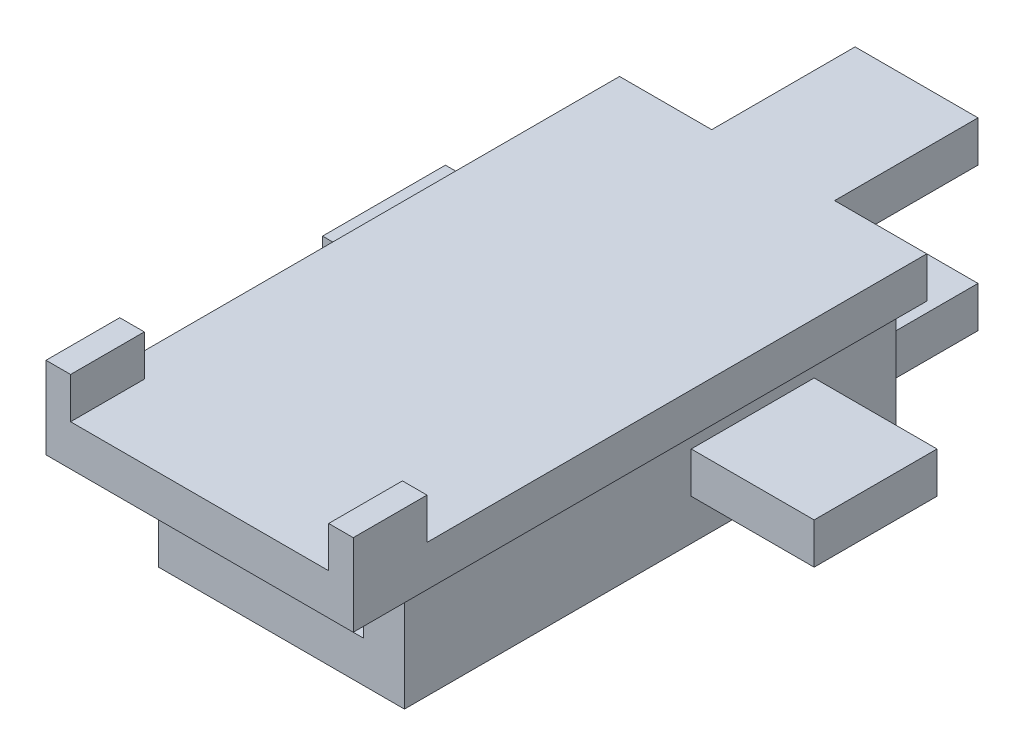
ISO-10303-21;
HEADER;
FILE_DESCRIPTION(('STEP AP214'),'2;1');
FILE_NAME('part.step','',(''),(''),'','','');
FILE_SCHEMA(('AUTOMOTIVE_DESIGN { 1 0 10303 214 1 1 1 1 }'));
ENDSEC;
DATA;
#1=APPLICATION_CONTEXT('core data for automotive mechanical design processes');
#2=APPLICATION_PROTOCOL_DEFINITION('international standard','automotive_design',2000,#1);
#3=PRODUCT_CONTEXT('',#1,'mechanical');
#4=PRODUCT('Part','Part','',(#3));
#5=PRODUCT_RELATED_PRODUCT_CATEGORY('part','',(#4));
#6=PRODUCT_DEFINITION_FORMATION('','',#4);
#7=PRODUCT_DEFINITION_CONTEXT('part definition',#1,'design');
#8=PRODUCT_DEFINITION('design','',#6,#7);
#9=PRODUCT_DEFINITION_SHAPE('','',#8);
#10=(LENGTH_UNIT() NAMED_UNIT(*) SI_UNIT(.MILLI.,.METRE.));
#11=(NAMED_UNIT(*) PLANE_ANGLE_UNIT() SI_UNIT($,.RADIAN.));
#12=(NAMED_UNIT(*) SI_UNIT($,.STERADIAN.) SOLID_ANGLE_UNIT());
#13=UNCERTAINTY_MEASURE_WITH_UNIT(LENGTH_MEASURE(1.E-05),#10,'distance_accuracy_value','');
#14=(GEOMETRIC_REPRESENTATION_CONTEXT(3) GLOBAL_UNCERTAINTY_ASSIGNED_CONTEXT((#13)) GLOBAL_UNIT_ASSIGNED_CONTEXT((#10,
#11,#12)) REPRESENTATION_CONTEXT('',''));
#15=CARTESIAN_POINT('',(0.,0.,0.));
#16=DIRECTION('',(0.,0.,1.));
#17=DIRECTION('',(1.,0.,0.));
#18=AXIS2_PLACEMENT_3D('',#15,#16,#17);
#19=CARTESIAN_POINT('',(3.,-3.,0.));
#20=DIRECTION('',(1.,0.,0.));
#21=DIRECTION('',(0.,0.,-1.));
#22=AXIS2_PLACEMENT_3D('',#19,#20,#21);
#23=PLANE('',#22);
#24=DIRECTION('',(0.,0.,-1.));
#25=VECTOR('',#24,1.);
#26=CARTESIAN_POINT('',(3.,0.,0.));
#27=LINE('',#26,#25);
#28=CARTESIAN_POINT('',(3.,0.,7.));
#29=VERTEX_POINT('',#28);
#30=CARTESIAN_POINT('',(3.,0.,-5.));
#31=VERTEX_POINT('',#30);
#32=EDGE_CURVE('E433',#29,#31,#27,.T.);
#33=ORIENTED_EDGE('',*,*,#32,.F.);
#34=DIRECTION('',(0.,1.,0.));
#35=VECTOR('',#34,1.);
#36=CARTESIAN_POINT('',(3.,-3.,7.));
#37=LINE('',#36,#35);
#38=CARTESIAN_POINT('',(3.,-3.,7.));
#39=VERTEX_POINT('',#38);
#40=EDGE_CURVE('E460',#39,#29,#37,.T.);
#41=ORIENTED_EDGE('',*,*,#40,.F.);
#42=DIRECTION('',(0.,0.,-1.));
#43=VECTOR('',#42,1.);
#44=CARTESIAN_POINT('',(3.,-3.,0.));
#45=LINE('',#44,#43);
#46=CARTESIAN_POINT('',(3.,-3.,-5.));
#47=VERTEX_POINT('',#46);
#48=EDGE_CURVE('E437',#39,#47,#45,.T.);
#49=ORIENTED_EDGE('',*,*,#48,.T.);
#50=DIRECTION('',(0.,1.,0.));
#51=VECTOR('',#50,1.);
#52=CARTESIAN_POINT('',(3.,-3.,-5.));
#53=LINE('',#52,#51);
#54=EDGE_CURVE('E463',#47,#31,#53,.T.);
#55=ORIENTED_EDGE('',*,*,#54,.T.);
#56=EDGE_LOOP('',(#33,#41,#49,#55));
#57=FACE_BOUND('',#56,.T.);
#58=DIRECTION('',(0.,-1.,0.));
#59=VECTOR('',#58,1.);
#60=CARTESIAN_POINT('',(3.,-1.,0.));
#61=LINE('',#60,#59);
#62=CARTESIAN_POINT('',(3.,-1.,0.));
#63=VERTEX_POINT('',#62);
#64=CARTESIAN_POINT('',(3.,-2.,0.));
#65=VERTEX_POINT('',#64);
#66=EDGE_CURVE('E59',#63,#65,#61,.T.);
#67=ORIENTED_EDGE('',*,*,#66,.F.);
#68=DIRECTION('',(0.,0.,1.));
#69=VECTOR('',#68,1.);
#70=CARTESIAN_POINT('',(3.,-1.,-3.));
#71=LINE('',#70,#69);
#72=CARTESIAN_POINT('',(3.,-1.,-3.));
#73=VERTEX_POINT('',#72);
#74=EDGE_CURVE('E287',#73,#63,#71,.T.);
#75=ORIENTED_EDGE('',*,*,#74,.F.);
#76=DIRECTION('',(0.,-1.,0.));
#77=VECTOR('',#76,1.);
#78=CARTESIAN_POINT('',(3.,-1.,-3.));
#79=LINE('',#78,#77);
#80=CARTESIAN_POINT('',(3.,-2.,-3.));
#81=VERTEX_POINT('',#80);
#82=EDGE_CURVE('E295',#73,#81,#79,.T.);
#83=ORIENTED_EDGE('',*,*,#82,.T.);
#84=DIRECTION('',(0.,0.,1.));
#85=VECTOR('',#84,1.);
#86=CARTESIAN_POINT('',(3.,-2.,-3.));
#87=LINE('',#86,#85);
#88=EDGE_CURVE('E307',#81,#65,#87,.T.);
#89=ORIENTED_EDGE('',*,*,#88,.T.);
#90=EDGE_LOOP('',(#67,#75,#83,#89));
#91=FACE_BOUND('',#90,.T.);
#92=ADVANCED_FACE('F36',(#57,#91),#23,.T.);
#93=CARTESIAN_POINT('',(0.,1.,0.));
#94=DIRECTION('',(0.,-1.,0.));
#95=DIRECTION('',(0.,0.,-1.));
#96=AXIS2_PLACEMENT_3D('',#93,#94,#95);
#97=PLANE('',#96);
#98=DIRECTION('',(-1.,0.,0.));
#99=VECTOR('',#98,1.);
#100=CARTESIAN_POINT('',(3.75,1.,7.2));
#101=LINE('',#100,#99);
#102=CARTESIAN_POINT('',(3.75,1.,7.2));
#103=VERTEX_POINT('',#102);
#104=CARTESIAN_POINT('',(3.15,1.,7.2));
#105=VERTEX_POINT('',#104);
#106=EDGE_CURVE('E320',#103,#105,#101,.T.);
#107=ORIENTED_EDGE('',*,*,#106,.F.);
#108=DIRECTION('',(0.,0.,-1.));
#109=VECTOR('',#108,1.);
#110=CARTESIAN_POINT('',(3.75,1.,5.));
#111=LINE('',#110,#109);
#112=CARTESIAN_POINT('',(3.75,1.,-5.));
#113=VERTEX_POINT('',#112);
#114=EDGE_CURVE('E496',#103,#113,#111,.T.);
#115=ORIENTED_EDGE('',*,*,#114,.T.);
#116=DIRECTION('',(-1.,0.,0.));
#117=VECTOR('',#116,1.);
#118=CARTESIAN_POINT('',(-3.75,1.,-5.));
#119=LINE('',#118,#117);
#120=CARTESIAN_POINT('',(1.5,1.,-5.));
#121=VERTEX_POINT('',#120);
#122=EDGE_CURVE('E500',#113,#121,#119,.T.);
#123=ORIENTED_EDGE('',*,*,#122,.T.);
#124=DIRECTION('',(0.,0.,1.));
#125=VECTOR('',#124,1.);
#126=CARTESIAN_POINT('',(1.5,1.,-10.));
#127=LINE('',#126,#125);
#128=CARTESIAN_POINT('',(1.5,1.,-8.5));
#129=VERTEX_POINT('',#128);
#130=EDGE_CURVE('E481',#129,#121,#127,.T.);
#131=ORIENTED_EDGE('',*,*,#130,.F.);
#132=DIRECTION('',(-1.,0.,0.));
#133=VECTOR('',#132,1.);
#134=CARTESIAN_POINT('',(0.,1.,-8.5));
#135=LINE('',#134,#133);
#136=CARTESIAN_POINT('',(-1.5,1.,-8.5));
#137=VERTEX_POINT('',#136);
#138=EDGE_CURVE('E368',#129,#137,#135,.T.);
#139=ORIENTED_EDGE('',*,*,#138,.T.);
#140=DIRECTION('',(0.,0.,1.));
#141=VECTOR('',#140,1.);
#142=CARTESIAN_POINT('',(-1.5,1.,-10.));
#143=LINE('',#142,#141);
#144=CARTESIAN_POINT('',(-1.5,1.,-5.));
#145=VERTEX_POINT('',#144);
#146=EDGE_CURVE('E483',#137,#145,#143,.T.);
#147=ORIENTED_EDGE('',*,*,#146,.T.);
#148=CARTESIAN_POINT('',(-3.75,1.,-5.));
#149=VERTEX_POINT('',#148);
#150=EDGE_CURVE('E498',#145,#149,#119,.T.);
#151=ORIENTED_EDGE('',*,*,#150,.T.);
#152=DIRECTION('',(0.,0.,1.));
#153=VECTOR('',#152,1.);
#154=CARTESIAN_POINT('',(-3.75,1.,5.));
#155=LINE('',#154,#153);
#156=CARTESIAN_POINT('',(-3.75,1.,7.2));
#157=VERTEX_POINT('',#156);
#158=EDGE_CURVE('E503',#149,#157,#155,.T.);
#159=ORIENTED_EDGE('',*,*,#158,.T.);
#160=DIRECTION('',(-1.,0.,0.));
#161=VECTOR('',#160,1.);
#162=CARTESIAN_POINT('',(-3.75,1.,7.2));
#163=LINE('',#162,#161);
#164=CARTESIAN_POINT('',(-3.15,1.,7.2));
#165=VERTEX_POINT('',#164);
#166=EDGE_CURVE('E347',#165,#157,#163,.T.);
#167=ORIENTED_EDGE('',*,*,#166,.F.);
#168=DIRECTION('',(0.,0.,-1.));
#169=VECTOR('',#168,1.);
#170=CARTESIAN_POINT('',(-3.15,1.,7.2));
#171=LINE('',#170,#169);
#172=CARTESIAN_POINT('',(-3.15,1.,9.));
#173=VERTEX_POINT('',#172);
#174=EDGE_CURVE('E342',#173,#165,#171,.T.);
#175=ORIENTED_EDGE('',*,*,#174,.F.);
#176=DIRECTION('',(-1.,0.,0.));
#177=VECTOR('',#176,1.);
#178=CARTESIAN_POINT('',(-3.75,1.,9.));
#179=LINE('',#178,#177);
#180=CARTESIAN_POINT('',(3.15,1.,9.));
#181=VERTEX_POINT('',#180);
#182=EDGE_CURVE('E493',#181,#173,#179,.T.);
#183=ORIENTED_EDGE('',*,*,#182,.F.);
#184=DIRECTION('',(0.,0.,1.));
#185=VECTOR('',#184,1.);
#186=CARTESIAN_POINT('',(3.15,1.,7.2));
#187=LINE('',#186,#185);
#188=EDGE_CURVE('E325',#105,#181,#187,.T.);
#189=ORIENTED_EDGE('',*,*,#188,.F.);
#190=EDGE_LOOP('',(#107,#115,#123,#131,#139,#147,#151,#159,#167,#175,#183,#189));
#191=FACE_BOUND('',#190,.T.);
#192=ADVANCED_FACE('F542',(#191),#97,.F.);
#193=CARTESIAN_POINT('',(-3.75,1.,-5.));
#194=DIRECTION('',(0.,0.,1.));
#195=DIRECTION('',(1.,0.,0.));
#196=AXIS2_PLACEMENT_3D('',#193,#194,#195);
#197=PLANE('',#196);
#198=DIRECTION('',(0.,-1.,0.));
#199=VECTOR('',#198,1.);
#200=CARTESIAN_POINT('',(2.,-2.,-5.));
#201=LINE('',#200,#199);
#202=CARTESIAN_POINT('',(2.,-2.,-5.));
#203=VERTEX_POINT('',#202);
#204=CARTESIAN_POINT('',(2.,-3.,-5.));
#205=VERTEX_POINT('',#204);
#206=EDGE_CURVE('E383',#203,#205,#201,.T.);
#207=ORIENTED_EDGE('',*,*,#206,.F.);
#208=DIRECTION('',(0.,1.,0.));
#209=VECTOR('',#208,1.);
#210=CARTESIAN_POINT('',(2.,0.,-5.));
#211=LINE('',#210,#209);
#212=CARTESIAN_POINT('',(2.,0.,-5.));
#213=VERTEX_POINT('',#212);
#214=EDGE_CURVE('E410',#203,#213,#211,.T.);
#215=ORIENTED_EDGE('',*,*,#214,.T.);
#216=DIRECTION('',(1.,0.,0.));
#217=VECTOR('',#216,1.);
#218=CARTESIAN_POINT('',(0.,0.,-5.));
#219=LINE('',#218,#217);
#220=CARTESIAN_POINT('',(1.5,0.,-5.));
#221=VERTEX_POINT('',#220);
#222=EDGE_CURVE('E414',#221,#213,#219,.T.);
#223=ORIENTED_EDGE('',*,*,#222,.F.);
#224=DIRECTION('',(0.,-1.,0.));
#225=VECTOR('',#224,1.);
#226=CARTESIAN_POINT('',(1.5,0.,-5.));
#227=LINE('',#226,#225);
#228=EDGE_CURVE('E472',#121,#221,#227,.T.);
#229=ORIENTED_EDGE('',*,*,#228,.F.);
#230=ORIENTED_EDGE('',*,*,#122,.F.);
#231=DIRECTION('',(0.,-1.,0.));
#232=VECTOR('',#231,1.);
#233=CARTESIAN_POINT('',(3.75,1.,-5.));
#234=LINE('',#233,#232);
#235=CARTESIAN_POINT('',(3.75,0.,-5.));
#236=VERTEX_POINT('',#235);
#237=EDGE_CURVE('E11',#113,#236,#234,.T.);
#238=ORIENTED_EDGE('',*,*,#237,.T.);
#239=DIRECTION('',(-1.,0.,0.));
#240=VECTOR('',#239,1.);
#241=CARTESIAN_POINT('',(-3.75,0.,-5.));
#242=LINE('',#241,#240);
#243=EDGE_CURVE('E508',#236,#31,#242,.T.);
#244=ORIENTED_EDGE('',*,*,#243,.T.);
#245=ORIENTED_EDGE('',*,*,#54,.F.);
#246=DIRECTION('',(-1.,0.,0.));
#247=VECTOR('',#246,1.);
#248=CARTESIAN_POINT('',(0.,-3.,-5.));
#249=LINE('',#248,#247);
#250=EDGE_CURVE('E434',#47,#205,#249,.T.);
#251=ORIENTED_EDGE('',*,*,#250,.T.);
#252=EDGE_LOOP('',(#207,#215,#223,#229,#230,#238,#244,#245,#251));
#253=FACE_BOUND('',#252,.T.);
#254=ADVANCED_FACE('F565',(#253),#197,.F.);
#255=DIRECTION('',(0.,1.,0.));
#256=VECTOR('',#255,1.);
#257=CARTESIAN_POINT('',(-2.,-2.,-5.));
#258=LINE('',#257,#256);
#259=CARTESIAN_POINT('',(-2.,-3.,-5.));
#260=VERTEX_POINT('',#259);
#261=CARTESIAN_POINT('',(-2.,-2.,-5.));
#262=VERTEX_POINT('',#261);
#263=EDGE_CURVE('E388',#260,#262,#258,.T.);
#264=ORIENTED_EDGE('',*,*,#263,.F.);
#265=CARTESIAN_POINT('',(-3.,-3.,-5.));
#266=VERTEX_POINT('',#265);
#267=EDGE_CURVE('E438',#260,#266,#249,.T.);
#268=ORIENTED_EDGE('',*,*,#267,.T.);
#269=DIRECTION('',(0.,1.,0.));
#270=VECTOR('',#269,1.);
#271=CARTESIAN_POINT('',(-3.,-3.,-5.));
#272=LINE('',#271,#270);
#273=CARTESIAN_POINT('',(-3.,0.,-5.));
#274=VERTEX_POINT('',#273);
#275=EDGE_CURVE('E447',#266,#274,#272,.T.);
#276=ORIENTED_EDGE('',*,*,#275,.T.);
#277=CARTESIAN_POINT('',(-3.75,0.,-5.));
#278=VERTEX_POINT('',#277);
#279=EDGE_CURVE('E507',#274,#278,#242,.T.);
#280=ORIENTED_EDGE('',*,*,#279,.T.);
#281=DIRECTION('',(0.,-1.,0.));
#282=VECTOR('',#281,1.);
#283=CARTESIAN_POINT('',(-3.75,1.,-5.));
#284=LINE('',#283,#282);
#285=EDGE_CURVE('E44',#149,#278,#284,.T.);
#286=ORIENTED_EDGE('',*,*,#285,.F.);
#287=ORIENTED_EDGE('',*,*,#150,.F.);
#288=DIRECTION('',(0.,1.,0.));
#289=VECTOR('',#288,1.);
#290=CARTESIAN_POINT('',(-1.5,0.,-5.));
#291=LINE('',#290,#289);
#292=CARTESIAN_POINT('',(-1.5,0.,-5.));
#293=VERTEX_POINT('',#292);
#294=EDGE_CURVE('E469',#293,#145,#291,.T.);
#295=ORIENTED_EDGE('',*,*,#294,.F.);
#296=CARTESIAN_POINT('',(-2.,0.,-5.));
#297=VERTEX_POINT('',#296);
#298=EDGE_CURVE('E431',#297,#293,#219,.T.);
#299=ORIENTED_EDGE('',*,*,#298,.F.);
#300=DIRECTION('',(0.,1.,0.));
#301=VECTOR('',#300,1.);
#302=CARTESIAN_POINT('',(-2.,0.,-5.));
#303=LINE('',#302,#301);
#304=EDGE_CURVE('E407',#262,#297,#303,.T.);
#305=ORIENTED_EDGE('',*,*,#304,.F.);
#306=EDGE_LOOP('',(#264,#268,#276,#280,#286,#287,#295,#299,#305));
#307=FACE_BOUND('',#306,.T.);
#308=ADVANCED_FACE('F579',(#307),#197,.F.);
#309=CARTESIAN_POINT('',(0.,-3.,7.));
#310=DIRECTION('',(0.,0.,1.));
#311=DIRECTION('',(1.,0.,0.));
#312=AXIS2_PLACEMENT_3D('',#309,#310,#311);
#313=PLANE('',#312);
#314=DIRECTION('',(1.,0.,0.));
#315=VECTOR('',#314,1.);
#316=CARTESIAN_POINT('',(0.,0.,7.));
#317=LINE('',#316,#315);
#318=CARTESIAN_POINT('',(2.,0.,7.));
#319=VERTEX_POINT('',#318);
#320=EDGE_CURVE('E450',#319,#29,#317,.T.);
#321=ORIENTED_EDGE('',*,*,#320,.F.);
#322=DIRECTION('',(0.,-1.,0.));
#323=VECTOR('',#322,1.);
#324=CARTESIAN_POINT('',(2.,0.,7.));
#325=LINE('',#324,#323);
#326=CARTESIAN_POINT('',(2.,-2.,7.));
#327=VERTEX_POINT('',#326);
#328=EDGE_CURVE('E406',#319,#327,#325,.T.);
#329=ORIENTED_EDGE('',*,*,#328,.T.);
#330=DIRECTION('',(1.,0.,0.));
#331=VECTOR('',#330,1.);
#332=CARTESIAN_POINT('',(0.,-2.,7.));
#333=LINE('',#332,#331);
#334=CARTESIAN_POINT('',(-2.,-2.,7.));
#335=VERTEX_POINT('',#334);
#336=EDGE_CURVE('E420',#335,#327,#333,.T.);
#337=ORIENTED_EDGE('',*,*,#336,.F.);
#338=DIRECTION('',(0.,-1.,0.));
#339=VECTOR('',#338,1.);
#340=CARTESIAN_POINT('',(-2.,0.,7.));
#341=LINE('',#340,#339);
#342=CARTESIAN_POINT('',(-2.,0.,7.));
#343=VERTEX_POINT('',#342);
#344=EDGE_CURVE('E417',#343,#335,#341,.T.);
#345=ORIENTED_EDGE('',*,*,#344,.F.);
#346=CARTESIAN_POINT('',(-3.,0.,7.));
#347=VERTEX_POINT('',#346);
#348=EDGE_CURVE('E451',#347,#343,#317,.T.);
#349=ORIENTED_EDGE('',*,*,#348,.F.);
#350=DIRECTION('',(0.,1.,0.));
#351=VECTOR('',#350,1.);
#352=CARTESIAN_POINT('',(-3.,-3.,7.));
#353=LINE('',#352,#351);
#354=CARTESIAN_POINT('',(-3.,-3.,7.));
#355=VERTEX_POINT('',#354);
#356=EDGE_CURVE('E458',#355,#347,#353,.T.);
#357=ORIENTED_EDGE('',*,*,#356,.F.);
#358=DIRECTION('',(1.,0.,0.));
#359=VECTOR('',#358,1.);
#360=CARTESIAN_POINT('',(0.,-3.,7.));
#361=LINE('',#360,#359);
#362=EDGE_CURVE('E441',#355,#39,#361,.T.);
#363=ORIENTED_EDGE('',*,*,#362,.T.);
#364=ORIENTED_EDGE('',*,*,#40,.T.);
#365=EDGE_LOOP('',(#321,#329,#337,#345,#349,#357,#363,#364));
#366=FACE_BOUND('',#365,.T.);
#367=ADVANCED_FACE('F609',(#366),#313,.T.);
#368=CARTESIAN_POINT('',(-1.5,0.,-10.));
#369=DIRECTION('',(1.,0.,0.));
#370=DIRECTION('',(0.,1.,0.));
#371=AXIS2_PLACEMENT_3D('',#368,#369,#370);
#372=PLANE('',#371);
#373=DIRECTION('',(0.,1.,0.));
#374=VECTOR('',#373,1.);
#375=CARTESIAN_POINT('',(-1.5,0.,-8.5));
#376=LINE('',#375,#374);
#377=CARTESIAN_POINT('',(-1.5,0.,-8.5));
#378=VERTEX_POINT('',#377);
#379=EDGE_CURVE('E465',#378,#137,#376,.T.);
#380=ORIENTED_EDGE('',*,*,#379,.F.);
#381=DIRECTION('',(0.,0.,1.));
#382=VECTOR('',#381,1.);
#383=CARTESIAN_POINT('',(-1.5,0.,-10.));
#384=LINE('',#383,#382);
#385=EDGE_CURVE('E475',#378,#293,#384,.T.);
#386=ORIENTED_EDGE('',*,*,#385,.T.);
#387=ORIENTED_EDGE('',*,*,#294,.T.);
#388=ORIENTED_EDGE('',*,*,#146,.F.);
#389=EDGE_LOOP('',(#380,#386,#387,#388));
#390=FACE_BOUND('',#389,.T.);
#391=ADVANCED_FACE('F574',(#390),#372,.F.);
#392=CARTESIAN_POINT('',(1.5,0.,-10.));
#393=DIRECTION('',(-1.,0.,0.));
#394=DIRECTION('',(0.,-1.,0.));
#395=AXIS2_PLACEMENT_3D('',#392,#393,#394);
#396=PLANE('',#395);
#397=DIRECTION('',(0.,-1.,0.));
#398=VECTOR('',#397,1.);
#399=CARTESIAN_POINT('',(1.5,0.,-8.5));
#400=LINE('',#399,#398);
#401=CARTESIAN_POINT('',(1.5,0.,-8.5));
#402=VERTEX_POINT('',#401);
#403=EDGE_CURVE('E467',#129,#402,#400,.T.);
#404=ORIENTED_EDGE('',*,*,#403,.F.);
#405=ORIENTED_EDGE('',*,*,#130,.T.);
#406=ORIENTED_EDGE('',*,*,#228,.T.);
#407=DIRECTION('',(0.,0.,1.));
#408=VECTOR('',#407,1.);
#409=CARTESIAN_POINT('',(1.5,0.,-10.));
#410=LINE('',#409,#408);
#411=EDGE_CURVE('E478',#402,#221,#410,.T.);
#412=ORIENTED_EDGE('',*,*,#411,.F.);
#413=EDGE_LOOP('',(#404,#405,#406,#412));
#414=FACE_BOUND('',#413,.T.);
#415=ADVANCED_FACE('F569',(#414),#396,.F.);
#416=CARTESIAN_POINT('',(3.75,1.,5.));
#417=DIRECTION('',(-1.,0.,0.));
#418=DIRECTION('',(0.,0.,1.));
#419=AXIS2_PLACEMENT_3D('',#416,#417,#418);
#420=PLANE('',#419);
#421=DIRECTION('',(0.,0.,-1.));
#422=VECTOR('',#421,1.);
#423=CARTESIAN_POINT('',(3.75,0.,5.));
#424=LINE('',#423,#422);
#425=CARTESIAN_POINT('',(3.75,0.,9.));
#426=VERTEX_POINT('',#425);
#427=EDGE_CURVE('E495',#426,#236,#424,.T.);
#428=ORIENTED_EDGE('',*,*,#427,.T.);
#429=ORIENTED_EDGE('',*,*,#237,.F.);
#430=ORIENTED_EDGE('',*,*,#114,.F.);
#431=DIRECTION('',(0.,-1.,0.));
#432=VECTOR('',#431,1.);
#433=CARTESIAN_POINT('',(3.75,2.,7.2));
#434=LINE('',#433,#432);
#435=CARTESIAN_POINT('',(3.75,2.,7.2));
#436=VERTEX_POINT('',#435);
#437=EDGE_CURVE('E332',#436,#103,#434,.T.);
#438=ORIENTED_EDGE('',*,*,#437,.F.);
#439=DIRECTION('',(0.,0.,-1.));
#440=VECTOR('',#439,1.);
#441=CARTESIAN_POINT('',(3.75,2.,7.2));
#442=LINE('',#441,#440);
#443=CARTESIAN_POINT('',(3.75,2.,9.));
#444=VERTEX_POINT('',#443);
#445=EDGE_CURVE('E330',#444,#436,#442,.T.);
#446=ORIENTED_EDGE('',*,*,#445,.F.);
#447=DIRECTION('',(0.,1.,0.));
#448=VECTOR('',#447,1.);
#449=CARTESIAN_POINT('',(3.75,1.,9.));
#450=LINE('',#449,#448);
#451=EDGE_CURVE('E491',#426,#444,#450,.T.);
#452=ORIENTED_EDGE('',*,*,#451,.F.);
#453=EDGE_LOOP('',(#428,#429,#430,#438,#446,#452));
#454=FACE_BOUND('',#453,.T.);
#455=ADVANCED_FACE('F38',(#454),#420,.F.);
#456=CARTESIAN_POINT('',(-3.75,1.,5.));
#457=DIRECTION('',(1.,0.,0.));
#458=DIRECTION('',(0.,0.,-1.));
#459=AXIS2_PLACEMENT_3D('',#456,#457,#458);
#460=PLANE('',#459);
#461=DIRECTION('',(0.,0.,1.));
#462=VECTOR('',#461,1.);
#463=CARTESIAN_POINT('',(-3.75,0.,5.));
#464=LINE('',#463,#462);
#465=CARTESIAN_POINT('',(-3.75,0.,9.));
#466=VERTEX_POINT('',#465);
#467=EDGE_CURVE('E499',#278,#466,#464,.T.);
#468=ORIENTED_EDGE('',*,*,#467,.T.);
#469=DIRECTION('',(0.,-1.,0.));
#470=VECTOR('',#469,1.);
#471=CARTESIAN_POINT('',(-3.75,1.,9.));
#472=LINE('',#471,#470);
#473=CARTESIAN_POINT('',(-3.75,2.,9.));
#474=VERTEX_POINT('',#473);
#475=EDGE_CURVE('E485',#474,#466,#472,.T.);
#476=ORIENTED_EDGE('',*,*,#475,.F.);
#477=DIRECTION('',(0.,0.,1.));
#478=VECTOR('',#477,1.);
#479=CARTESIAN_POINT('',(-3.75,2.,7.2));
#480=LINE('',#479,#478);
#481=CARTESIAN_POINT('',(-3.75,2.,7.2));
#482=VERTEX_POINT('',#481);
#483=EDGE_CURVE('E343',#482,#474,#480,.T.);
#484=ORIENTED_EDGE('',*,*,#483,.F.);
#485=DIRECTION('',(0.,-1.,0.));
#486=VECTOR('',#485,1.);
#487=CARTESIAN_POINT('',(-3.75,2.,7.2));
#488=LINE('',#487,#486);
#489=EDGE_CURVE('E353',#482,#157,#488,.T.);
#490=ORIENTED_EDGE('',*,*,#489,.T.);
#491=ORIENTED_EDGE('',*,*,#158,.F.);
#492=ORIENTED_EDGE('',*,*,#285,.T.);
#493=EDGE_LOOP('',(#468,#476,#484,#490,#491,#492));
#494=FACE_BOUND('',#493,.T.);
#495=ADVANCED_FACE('F516',(#494),#460,.F.);
#496=CARTESIAN_POINT('',(0.,0.,0.));
#497=DIRECTION('',(0.,-1.,0.));
#498=DIRECTION('',(0.,0.,-1.));
#499=AXIS2_PLACEMENT_3D('',#496,#497,#498);
#500=PLANE('',#499);
#501=DIRECTION('',(-1.,0.,0.));
#502=VECTOR('',#501,1.);
#503=CARTESIAN_POINT('',(-3.5,0.,-8.5));
#504=LINE('',#503,#502);
#505=EDGE_CURVE('E366',#402,#378,#504,.T.);
#506=ORIENTED_EDGE('',*,*,#505,.F.);
#507=ORIENTED_EDGE('',*,*,#411,.T.);
#508=ORIENTED_EDGE('',*,*,#222,.T.);
#509=DIRECTION('',(0.,0.,1.));
#510=VECTOR('',#509,1.);
#511=CARTESIAN_POINT('',(2.,0.,-9.47213595499958));
#512=LINE('',#511,#510);
#513=EDGE_CURVE('E423',#213,#319,#512,.T.);
#514=ORIENTED_EDGE('',*,*,#513,.T.);
#515=ORIENTED_EDGE('',*,*,#320,.T.);
#516=ORIENTED_EDGE('',*,*,#32,.T.);
#517=ORIENTED_EDGE('',*,*,#243,.F.);
#518=ORIENTED_EDGE('',*,*,#427,.F.);
#519=DIRECTION('',(1.,0.,0.));
#520=VECTOR('',#519,1.);
#521=CARTESIAN_POINT('',(-3.75,0.,9.));
#522=LINE('',#521,#520);
#523=EDGE_CURVE('E488',#466,#426,#522,.T.);
#524=ORIENTED_EDGE('',*,*,#523,.F.);
#525=ORIENTED_EDGE('',*,*,#467,.F.);
#526=ORIENTED_EDGE('',*,*,#279,.F.);
#527=DIRECTION('',(0.,0.,-1.));
#528=VECTOR('',#527,1.);
#529=CARTESIAN_POINT('',(-3.,0.,0.));
#530=LINE('',#529,#528);
#531=EDGE_CURVE('E454',#347,#274,#530,.T.);
#532=ORIENTED_EDGE('',*,*,#531,.F.);
#533=ORIENTED_EDGE('',*,*,#348,.T.);
#534=DIRECTION('',(0.,0.,1.));
#535=VECTOR('',#534,1.);
#536=CARTESIAN_POINT('',(-2.,0.,-9.47213595499958));
#537=LINE('',#536,#535);
#538=EDGE_CURVE('E427',#297,#343,#537,.T.);
#539=ORIENTED_EDGE('',*,*,#538,.F.);
#540=ORIENTED_EDGE('',*,*,#298,.T.);
#541=ORIENTED_EDGE('',*,*,#385,.F.);
#542=EDGE_LOOP('',(#506,#507,#508,#514,#515,#516,#517,#518,#524,#525,#526,#532,#533,#539,#540,#541));
#543=FACE_BOUND('',#542,.T.);
#544=ADVANCED_FACE('F523',(#543),#500,.T.);
#545=CARTESIAN_POINT('',(0.,0.,9.));
#546=DIRECTION('',(0.,0.,1.));
#547=DIRECTION('',(1.,0.,0.));
#548=AXIS2_PLACEMENT_3D('',#545,#546,#547);
#549=PLANE('',#548);
#550=ORIENTED_EDGE('',*,*,#475,.T.);
#551=ORIENTED_EDGE('',*,*,#523,.T.);
#552=ORIENTED_EDGE('',*,*,#451,.T.);
#553=DIRECTION('',(1.,0.,0.));
#554=VECTOR('',#553,1.);
#555=CARTESIAN_POINT('',(3.75,2.,9.));
#556=LINE('',#555,#554);
#557=CARTESIAN_POINT('',(3.15,2.,9.));
#558=VERTEX_POINT('',#557);
#559=EDGE_CURVE('E327',#558,#444,#556,.T.);
#560=ORIENTED_EDGE('',*,*,#559,.F.);
#561=DIRECTION('',(0.,-1.,0.));
#562=VECTOR('',#561,1.);
#563=CARTESIAN_POINT('',(3.15,2.,9.));
#564=LINE('',#563,#562);
#565=EDGE_CURVE('E338',#558,#181,#564,.T.);
#566=ORIENTED_EDGE('',*,*,#565,.T.);
#567=ORIENTED_EDGE('',*,*,#182,.T.);
#568=DIRECTION('',(0.,-1.,0.));
#569=VECTOR('',#568,1.);
#570=CARTESIAN_POINT('',(-3.15,2.,9.));
#571=LINE('',#570,#569);
#572=CARTESIAN_POINT('',(-3.15,2.,9.));
#573=VERTEX_POINT('',#572);
#574=EDGE_CURVE('E363',#573,#173,#571,.T.);
#575=ORIENTED_EDGE('',*,*,#574,.F.);
#576=DIRECTION('',(1.,0.,0.));
#577=VECTOR('',#576,1.);
#578=CARTESIAN_POINT('',(-3.75,2.,9.));
#579=LINE('',#578,#577);
#580=EDGE_CURVE('E346',#474,#573,#579,.T.);
#581=ORIENTED_EDGE('',*,*,#580,.F.);
#582=EDGE_LOOP('',(#550,#551,#552,#560,#566,#567,#575,#581));
#583=FACE_BOUND('',#582,.T.);
#584=ADVANCED_FACE('F528',(#583),#549,.T.);
#585=CARTESIAN_POINT('',(-3.,-3.,0.));
#586=DIRECTION('',(1.,0.,0.));
#587=DIRECTION('',(0.,0.,-1.));
#588=AXIS2_PLACEMENT_3D('',#585,#586,#587);
#589=PLANE('',#588);
#590=DIRECTION('',(0.,-1.,0.));
#591=VECTOR('',#590,1.);
#592=CARTESIAN_POINT('',(-3.,-1.,-3.));
#593=LINE('',#592,#591);
#594=CARTESIAN_POINT('',(-3.,-1.,-3.));
#595=VERTEX_POINT('',#594);
#596=CARTESIAN_POINT('',(-3.,-2.,-3.));
#597=VERTEX_POINT('',#596);
#598=EDGE_CURVE('E276',#595,#597,#593,.T.);
#599=ORIENTED_EDGE('',*,*,#598,.F.);
#600=DIRECTION('',(0.,0.,1.));
#601=VECTOR('',#600,1.);
#602=CARTESIAN_POINT('',(-3.,-1.,-3.));
#603=LINE('',#602,#601);
#604=CARTESIAN_POINT('',(-3.,-1.,0.));
#605=VERTEX_POINT('',#604);
#606=EDGE_CURVE('E282',#595,#605,#603,.T.);
#607=ORIENTED_EDGE('',*,*,#606,.T.);
#608=DIRECTION('',(0.,-1.,0.));
#609=VECTOR('',#608,1.);
#610=CARTESIAN_POINT('',(-3.,-1.,0.));
#611=LINE('',#610,#609);
#612=CARTESIAN_POINT('',(-3.,-2.,0.));
#613=VERTEX_POINT('',#612);
#614=EDGE_CURVE('E258',#605,#613,#611,.T.);
#615=ORIENTED_EDGE('',*,*,#614,.T.);
#616=DIRECTION('',(0.,0.,1.));
#617=VECTOR('',#616,1.);
#618=CARTESIAN_POINT('',(-3.,-2.,-3.));
#619=LINE('',#618,#617);
#620=EDGE_CURVE('E51',#597,#613,#619,.T.);
#621=ORIENTED_EDGE('',*,*,#620,.F.);
#622=EDGE_LOOP('',(#599,#607,#615,#621));
#623=FACE_BOUND('',#622,.T.);
#624=ORIENTED_EDGE('',*,*,#531,.T.);
#625=ORIENTED_EDGE('',*,*,#275,.F.);
#626=DIRECTION('',(0.,0.,-1.));
#627=VECTOR('',#626,1.);
#628=CARTESIAN_POINT('',(-3.,-3.,0.));
#629=LINE('',#628,#627);
#630=EDGE_CURVE('E444',#355,#266,#629,.T.);
#631=ORIENTED_EDGE('',*,*,#630,.F.);
#632=ORIENTED_EDGE('',*,*,#356,.T.);
#633=EDGE_LOOP('',(#624,#625,#631,#632));
#634=FACE_BOUND('',#633,.T.);
#635=ADVANCED_FACE('F606',(#623,#634),#589,.F.);
#636=CARTESIAN_POINT('',(0.,-3.,0.));
#637=DIRECTION('',(0.,-1.,0.));
#638=DIRECTION('',(0.,0.,-1.));
#639=AXIS2_PLACEMENT_3D('',#636,#637,#638);
#640=PLANE('',#639);
#641=CARTESIAN_POINT('',(0.,-3.,-5.));
#642=DIRECTION('',(0.,-1.,0.));
#643=DIRECTION('',(0.,0.,-1.));
#644=AXIS2_PLACEMENT_3D('',#641,#642,#643);
#645=CIRCLE('',#644,1.);
#646=CARTESIAN_POINT('',(0.,-3.,-6.));
#647=VERTEX_POINT('',#646);
#648=EDGE_CURVE('E371',#647,#647,#645,.T.);
#649=ORIENTED_EDGE('',*,*,#648,.F.);
#650=EDGE_LOOP('',(#649));
#651=FACE_BOUND('',#650,.T.);
#652=CARTESIAN_POINT('',(0.,-3.,5.));
#653=DIRECTION('',(0.,-1.,0.));
#654=DIRECTION('',(0.,0.,-1.));
#655=AXIS2_PLACEMENT_3D('',#652,#653,#654);
#656=CIRCLE('',#655,1.);
#657=CARTESIAN_POINT('',(0.,-3.,4.));
#658=VERTEX_POINT('',#657);
#659=EDGE_CURVE('E377',#658,#658,#656,.T.);
#660=ORIENTED_EDGE('',*,*,#659,.F.);
#661=EDGE_LOOP('',(#660));
#662=FACE_BOUND('',#661,.T.);
#663=ORIENTED_EDGE('',*,*,#250,.F.);
#664=ORIENTED_EDGE('',*,*,#48,.F.);
#665=ORIENTED_EDGE('',*,*,#362,.F.);
#666=ORIENTED_EDGE('',*,*,#630,.T.);
#667=ORIENTED_EDGE('',*,*,#267,.F.);
#668=DIRECTION('',(0.,0.,1.));
#669=VECTOR('',#668,1.);
#670=CARTESIAN_POINT('',(-2.,-3.,-8.));
#671=LINE('',#670,#669);
#672=CARTESIAN_POINT('',(-2.,-3.,-8.));
#673=VERTEX_POINT('',#672);
#674=EDGE_CURVE('E402',#673,#260,#671,.T.);
#675=ORIENTED_EDGE('',*,*,#674,.F.);
#676=DIRECTION('',(-1.,0.,0.));
#677=VECTOR('',#676,1.);
#678=CARTESIAN_POINT('',(2.,-3.,-8.));
#679=LINE('',#678,#677);
#680=CARTESIAN_POINT('',(2.,-3.,-8.));
#681=VERTEX_POINT('',#680);
#682=EDGE_CURVE('E387',#681,#673,#679,.T.);
#683=ORIENTED_EDGE('',*,*,#682,.F.);
#684=DIRECTION('',(0.,0.,1.));
#685=VECTOR('',#684,1.);
#686=CARTESIAN_POINT('',(2.,-3.,-8.));
#687=LINE('',#686,#685);
#688=EDGE_CURVE('E404',#681,#205,#687,.T.);
#689=ORIENTED_EDGE('',*,*,#688,.T.);
#690=EDGE_LOOP('',(#663,#664,#665,#666,#667,#675,#683,#689));
#691=FACE_BOUND('',#690,.T.);
#692=ADVANCED_FACE('F600',(#651,#662,#691),#640,.T.);
#693=CARTESIAN_POINT('',(2.,0.,-9.47213595499958));
#694=DIRECTION('',(-1.,0.,0.));
#695=DIRECTION('',(0.,-1.,0.));
#696=AXIS2_PLACEMENT_3D('',#693,#694,#695);
#697=PLANE('',#696);
#698=DIRECTION('',(0.,0.,1.));
#699=VECTOR('',#698,1.);
#700=CARTESIAN_POINT('',(2.,-2.,-9.47213595499958));
#701=LINE('',#700,#699);
#702=EDGE_CURVE('E411',#203,#327,#701,.T.);
#703=ORIENTED_EDGE('',*,*,#702,.T.);
#704=ORIENTED_EDGE('',*,*,#328,.F.);
#705=ORIENTED_EDGE('',*,*,#513,.F.);
#706=ORIENTED_EDGE('',*,*,#214,.F.);
#707=EDGE_LOOP('',(#703,#704,#705,#706));
#708=FACE_BOUND('',#707,.T.);
#709=ADVANCED_FACE('F612',(#708),#697,.T.);
#710=CARTESIAN_POINT('',(0.,-2.,-9.47213595499958));
#711=DIRECTION('',(0.,-1.,0.));
#712=DIRECTION('',(1.,0.,0.));
#713=AXIS2_PLACEMENT_3D('',#710,#711,#712);
#714=PLANE('',#713);
#715=CARTESIAN_POINT('',(0.,-2.,-5.));
#716=DIRECTION('',(0.,-1.,0.));
#717=DIRECTION('',(1.,0.,0.));
#718=AXIS2_PLACEMENT_3D('',#715,#716,#717);
#719=CIRCLE('',#718,1.);
#720=CARTESIAN_POINT('',(1.,-2.,-5.));
#721=VERTEX_POINT('',#720);
#722=EDGE_CURVE('E374',#721,#721,#719,.F.);
#723=ORIENTED_EDGE('',*,*,#722,.F.);
#724=EDGE_LOOP('',(#723));
#725=FACE_BOUND('',#724,.T.);
#726=CARTESIAN_POINT('',(0.,-2.,5.));
#727=DIRECTION('',(0.,-1.,0.));
#728=DIRECTION('',(1.,0.,0.));
#729=AXIS2_PLACEMENT_3D('',#726,#727,#728);
#730=CIRCLE('',#729,1.);
#731=CARTESIAN_POINT('',(1.,-2.,5.));
#732=VERTEX_POINT('',#731);
#733=EDGE_CURVE('E380',#732,#732,#730,.F.);
#734=ORIENTED_EDGE('',*,*,#733,.F.);
#735=EDGE_LOOP('',(#734));
#736=FACE_BOUND('',#735,.T.);
#737=ORIENTED_EDGE('',*,*,#702,.F.);
#738=DIRECTION('',(0.,0.,1.));
#739=VECTOR('',#738,1.);
#740=CARTESIAN_POINT('',(2.,-2.,-8.));
#741=LINE('',#740,#739);
#742=CARTESIAN_POINT('',(2.,-2.,-8.));
#743=VERTEX_POINT('',#742);
#744=EDGE_CURVE('E394',#743,#203,#741,.T.);
#745=ORIENTED_EDGE('',*,*,#744,.F.);
#746=DIRECTION('',(1.,0.,0.));
#747=VECTOR('',#746,1.);
#748=CARTESIAN_POINT('',(2.,-2.,-8.));
#749=LINE('',#748,#747);
#750=CARTESIAN_POINT('',(-2.,-2.,-8.));
#751=VERTEX_POINT('',#750);
#752=EDGE_CURVE('E392',#751,#743,#749,.T.);
#753=ORIENTED_EDGE('',*,*,#752,.F.);
#754=DIRECTION('',(0.,0.,1.));
#755=VECTOR('',#754,1.);
#756=CARTESIAN_POINT('',(-2.,-2.,-8.));
#757=LINE('',#756,#755);
#758=EDGE_CURVE('E400',#751,#262,#757,.T.);
#759=ORIENTED_EDGE('',*,*,#758,.T.);
#760=DIRECTION('',(0.,0.,1.));
#761=VECTOR('',#760,1.);
#762=CARTESIAN_POINT('',(-2.,-2.,-9.47213595499958));
#763=LINE('',#762,#761);
#764=EDGE_CURVE('E425',#262,#335,#763,.T.);
#765=ORIENTED_EDGE('',*,*,#764,.T.);
#766=ORIENTED_EDGE('',*,*,#336,.T.);
#767=EDGE_LOOP('',(#737,#745,#753,#759,#765,#766));
#768=FACE_BOUND('',#767,.T.);
#769=ADVANCED_FACE('F589',(#725,#736,#768),#714,.F.);
#770=CARTESIAN_POINT('',(-2.,0.,-9.47213595499958));
#771=DIRECTION('',(-1.,0.,0.));
#772=DIRECTION('',(0.,0.,1.));
#773=AXIS2_PLACEMENT_3D('',#770,#771,#772);
#774=PLANE('',#773);
#775=ORIENTED_EDGE('',*,*,#304,.T.);
#776=ORIENTED_EDGE('',*,*,#538,.T.);
#777=ORIENTED_EDGE('',*,*,#344,.T.);
#778=ORIENTED_EDGE('',*,*,#764,.F.);
#779=EDGE_LOOP('',(#775,#776,#777,#778));
#780=FACE_BOUND('',#779,.T.);
#781=ADVANCED_FACE('F585',(#780),#774,.F.);
#782=CARTESIAN_POINT('',(2.,-2.,-8.));
#783=DIRECTION('',(-1.,0.,0.));
#784=DIRECTION('',(0.,0.,1.));
#785=AXIS2_PLACEMENT_3D('',#782,#783,#784);
#786=PLANE('',#785);
#787=ORIENTED_EDGE('',*,*,#206,.T.);
#788=ORIENTED_EDGE('',*,*,#688,.F.);
#789=DIRECTION('',(0.,-1.,0.));
#790=VECTOR('',#789,1.);
#791=CARTESIAN_POINT('',(2.,-2.,-8.));
#792=LINE('',#791,#790);
#793=EDGE_CURVE('E384',#743,#681,#792,.T.);
#794=ORIENTED_EDGE('',*,*,#793,.F.);
#795=ORIENTED_EDGE('',*,*,#744,.T.);
#796=EDGE_LOOP('',(#787,#788,#794,#795));
#797=FACE_BOUND('',#796,.T.);
#798=ADVANCED_FACE('F719',(#797),#786,.F.);
#799=CARTESIAN_POINT('',(-2.,-2.,-8.));
#800=DIRECTION('',(1.,0.,0.));
#801=DIRECTION('',(0.,0.,-1.));
#802=AXIS2_PLACEMENT_3D('',#799,#800,#801);
#803=PLANE('',#802);
#804=ORIENTED_EDGE('',*,*,#263,.T.);
#805=ORIENTED_EDGE('',*,*,#758,.F.);
#806=DIRECTION('',(0.,1.,0.));
#807=VECTOR('',#806,1.);
#808=CARTESIAN_POINT('',(-2.,-2.,-8.));
#809=LINE('',#808,#807);
#810=EDGE_CURVE('E390',#673,#751,#809,.T.);
#811=ORIENTED_EDGE('',*,*,#810,.F.);
#812=ORIENTED_EDGE('',*,*,#674,.T.);
#813=EDGE_LOOP('',(#804,#805,#811,#812));
#814=FACE_BOUND('',#813,.T.);
#815=ADVANCED_FACE('F595',(#814),#803,.F.);
#816=CARTESIAN_POINT('',(0.,0.,-8.));
#817=DIRECTION('',(0.,0.,-1.));
#818=DIRECTION('',(-1.,0.,0.));
#819=AXIS2_PLACEMENT_3D('',#816,#817,#818);
#820=PLANE('',#819);
#821=ORIENTED_EDGE('',*,*,#793,.T.);
#822=ORIENTED_EDGE('',*,*,#682,.T.);
#823=ORIENTED_EDGE('',*,*,#810,.T.);
#824=ORIENTED_EDGE('',*,*,#752,.T.);
#825=EDGE_LOOP('',(#821,#822,#823,#824));
#826=FACE_BOUND('',#825,.T.);
#827=ADVANCED_FACE('F733',(#826),#820,.T.);
#828=CARTESIAN_POINT('',(0.,0.82842712474619,5.));
#829=DIRECTION('',(0.,-1.,0.));
#830=DIRECTION('',(0.,0.,-1.));
#831=AXIS2_PLACEMENT_3D('',#828,#829,#830);
#832=CYLINDRICAL_SURFACE('',#831,1.);
#833=ORIENTED_EDGE('',*,*,#733,.T.);
#834=EDGE_LOOP('',(#833));
#835=FACE_BOUND('',#834,.T.);
#836=ORIENTED_EDGE('',*,*,#659,.T.);
#837=EDGE_LOOP('',(#836));
#838=FACE_BOUND('',#837,.T.);
#839=ADVANCED_FACE('F623',(#835,#838),#832,.F.);
#840=CARTESIAN_POINT('',(0.,0.82842712474619,-5.));
#841=DIRECTION('',(0.,-1.,0.));
#842=DIRECTION('',(0.,0.,-1.));
#843=AXIS2_PLACEMENT_3D('',#840,#841,#842);
#844=CYLINDRICAL_SURFACE('',#843,1.);
#845=ORIENTED_EDGE('',*,*,#722,.T.);
#846=EDGE_LOOP('',(#845));
#847=FACE_BOUND('',#846,.T.);
#848=ORIENTED_EDGE('',*,*,#648,.T.);
#849=EDGE_LOOP('',(#848));
#850=FACE_BOUND('',#849,.T.);
#851=ADVANCED_FACE('F616',(#847,#850),#844,.F.);
#852=CARTESIAN_POINT('',(-3.5,10.,-8.5));
#853=DIRECTION('',(0.,0.,1.));
#854=DIRECTION('',(1.,0.,0.));
#855=AXIS2_PLACEMENT_3D('',#852,#853,#854);
#856=PLANE('',#855);
#857=ORIENTED_EDGE('',*,*,#138,.F.);
#858=ORIENTED_EDGE('',*,*,#403,.T.);
#859=ORIENTED_EDGE('',*,*,#505,.T.);
#860=ORIENTED_EDGE('',*,*,#379,.T.);
#861=EDGE_LOOP('',(#857,#858,#859,#860));
#862=FACE_BOUND('',#861,.T.);
#863=ADVANCED_FACE('F614',(#862),#856,.F.);
#864=CARTESIAN_POINT('',(-3.15,2.,7.2));
#865=DIRECTION('',(-1.,0.,0.));
#866=DIRECTION('',(0.,0.,1.));
#867=AXIS2_PLACEMENT_3D('',#864,#865,#866);
#868=PLANE('',#867);
#869=ORIENTED_EDGE('',*,*,#174,.T.);
#870=DIRECTION('',(0.,-1.,0.));
#871=VECTOR('',#870,1.);
#872=CARTESIAN_POINT('',(-3.15,2.,7.2));
#873=LINE('',#872,#871);
#874=CARTESIAN_POINT('',(-3.15,2.,7.2));
#875=VERTEX_POINT('',#874);
#876=EDGE_CURVE('E360',#875,#165,#873,.T.);
#877=ORIENTED_EDGE('',*,*,#876,.F.);
#878=DIRECTION('',(0.,0.,-1.));
#879=VECTOR('',#878,1.);
#880=CARTESIAN_POINT('',(-3.15,2.,7.2));
#881=LINE('',#880,#879);
#882=EDGE_CURVE('E349',#573,#875,#881,.T.);
#883=ORIENTED_EDGE('',*,*,#882,.F.);
#884=ORIENTED_EDGE('',*,*,#574,.T.);
#885=EDGE_LOOP('',(#869,#877,#883,#884));
#886=FACE_BOUND('',#885,.T.);
#887=ADVANCED_FACE('F545',(#886),#868,.F.);
#888=CARTESIAN_POINT('',(-3.75,2.,7.2));
#889=DIRECTION('',(0.,0.,1.));
#890=DIRECTION('',(1.,0.,0.));
#891=AXIS2_PLACEMENT_3D('',#888,#889,#890);
#892=PLANE('',#891);
#893=ORIENTED_EDGE('',*,*,#166,.T.);
#894=ORIENTED_EDGE('',*,*,#489,.F.);
#895=DIRECTION('',(-1.,0.,0.));
#896=VECTOR('',#895,1.);
#897=CARTESIAN_POINT('',(-3.75,2.,7.2));
#898=LINE('',#897,#896);
#899=EDGE_CURVE('E351',#875,#482,#898,.T.);
#900=ORIENTED_EDGE('',*,*,#899,.F.);
#901=ORIENTED_EDGE('',*,*,#876,.T.);
#902=EDGE_LOOP('',(#893,#894,#900,#901));
#903=FACE_BOUND('',#902,.T.);
#904=ADVANCED_FACE('F538',(#903),#892,.F.);
#905=CARTESIAN_POINT('',(0.,2.,0.));
#906=DIRECTION('',(0.,1.,0.));
#907=DIRECTION('',(0.,0.,1.));
#908=AXIS2_PLACEMENT_3D('',#905,#906,#907);
#909=PLANE('',#908);
#910=ORIENTED_EDGE('',*,*,#483,.T.);
#911=ORIENTED_EDGE('',*,*,#580,.T.);
#912=ORIENTED_EDGE('',*,*,#882,.T.);
#913=ORIENTED_EDGE('',*,*,#899,.T.);
#914=EDGE_LOOP('',(#910,#911,#912,#913));
#915=FACE_BOUND('',#914,.T.);
#916=ADVANCED_FACE('F533',(#915),#909,.T.);
#917=CARTESIAN_POINT('',(3.75,2.,7.2));
#918=DIRECTION('',(0.,0.,1.));
#919=DIRECTION('',(1.,0.,0.));
#920=AXIS2_PLACEMENT_3D('',#917,#918,#919);
#921=PLANE('',#920);
#922=ORIENTED_EDGE('',*,*,#106,.T.);
#923=DIRECTION('',(0.,-1.,0.));
#924=VECTOR('',#923,1.);
#925=CARTESIAN_POINT('',(3.15,2.,7.2));
#926=LINE('',#925,#924);
#927=CARTESIAN_POINT('',(3.15,2.,7.2));
#928=VERTEX_POINT('',#927);
#929=EDGE_CURVE('E340',#928,#105,#926,.T.);
#930=ORIENTED_EDGE('',*,*,#929,.F.);
#931=DIRECTION('',(-1.,0.,0.));
#932=VECTOR('',#931,1.);
#933=CARTESIAN_POINT('',(3.75,2.,7.2));
#934=LINE('',#933,#932);
#935=EDGE_CURVE('E321',#436,#928,#934,.T.);
#936=ORIENTED_EDGE('',*,*,#935,.F.);
#937=ORIENTED_EDGE('',*,*,#437,.T.);
#938=EDGE_LOOP('',(#922,#930,#936,#937));
#939=FACE_BOUND('',#938,.T.);
#940=ADVANCED_FACE('F555',(#939),#921,.F.);
#941=CARTESIAN_POINT('',(3.15,2.,7.2));
#942=DIRECTION('',(1.,0.,0.));
#943=DIRECTION('',(0.,0.,-1.));
#944=AXIS2_PLACEMENT_3D('',#941,#942,#943);
#945=PLANE('',#944);
#946=ORIENTED_EDGE('',*,*,#188,.T.);
#947=ORIENTED_EDGE('',*,*,#565,.F.);
#948=DIRECTION('',(0.,0.,1.));
#949=VECTOR('',#948,1.);
#950=CARTESIAN_POINT('',(3.15,2.,7.2));
#951=LINE('',#950,#949);
#952=EDGE_CURVE('E324',#928,#558,#951,.T.);
#953=ORIENTED_EDGE('',*,*,#952,.F.);
#954=ORIENTED_EDGE('',*,*,#929,.T.);
#955=EDGE_LOOP('',(#946,#947,#953,#954));
#956=FACE_BOUND('',#955,.T.);
#957=ADVANCED_FACE('F551',(#956),#945,.F.);
#958=CARTESIAN_POINT('',(0.,2.,0.));
#959=DIRECTION('',(0.,1.,0.));
#960=DIRECTION('',(0.,0.,1.));
#961=AXIS2_PLACEMENT_3D('',#958,#959,#960);
#962=PLANE('',#961);
#963=ORIENTED_EDGE('',*,*,#935,.T.);
#964=ORIENTED_EDGE('',*,*,#952,.T.);
#965=ORIENTED_EDGE('',*,*,#559,.T.);
#966=ORIENTED_EDGE('',*,*,#445,.T.);
#967=EDGE_LOOP('',(#963,#964,#965,#966));
#968=FACE_BOUND('',#967,.T.);
#969=ADVANCED_FACE('F832',(#968),#962,.T.);
#970=CARTESIAN_POINT('',(6.,-1.,-3.));
#971=DIRECTION('',(0.,-1.,0.));
#972=DIRECTION('',(0.,0.,-1.));
#973=AXIS2_PLACEMENT_3D('',#970,#971,#972);
#974=PLANE('',#973);
#975=ORIENTED_EDGE('',*,*,#74,.T.);
#976=DIRECTION('',(-1.,0.,0.));
#977=VECTOR('',#976,1.);
#978=CARTESIAN_POINT('',(6.,-1.,0.));
#979=LINE('',#978,#977);
#980=CARTESIAN_POINT('',(6.,-1.,0.));
#981=VERTEX_POINT('',#980);
#982=EDGE_CURVE('E318',#981,#63,#979,.T.);
#983=ORIENTED_EDGE('',*,*,#982,.F.);
#984=DIRECTION('',(0.,0.,1.));
#985=VECTOR('',#984,1.);
#986=CARTESIAN_POINT('',(6.,-1.,-3.));
#987=LINE('',#986,#985);
#988=CARTESIAN_POINT('',(6.,-1.,-3.));
#989=VERTEX_POINT('',#988);
#990=EDGE_CURVE('E291',#989,#981,#987,.T.);
#991=ORIENTED_EDGE('',*,*,#990,.F.);
#992=DIRECTION('',(-1.,0.,0.));
#993=VECTOR('',#992,1.);
#994=CARTESIAN_POINT('',(6.,-1.,-3.));
#995=LINE('',#994,#993);
#996=EDGE_CURVE('E303',#989,#73,#995,.T.);
#997=ORIENTED_EDGE('',*,*,#996,.T.);
#998=EDGE_LOOP('',(#975,#983,#991,#997));
#999=FACE_BOUND('',#998,.T.);
#1000=ADVANCED_FACE('F840',(#999),#974,.F.);
#1001=CARTESIAN_POINT('',(6.,-1.,0.));
#1002=DIRECTION('',(0.,0.,-1.));
#1003=DIRECTION('',(0.,1.,0.));
#1004=AXIS2_PLACEMENT_3D('',#1001,#1002,#1003);
#1005=PLANE('',#1004);
#1006=ORIENTED_EDGE('',*,*,#66,.T.);
#1007=DIRECTION('',(-1.,0.,0.));
#1008=VECTOR('',#1007,1.);
#1009=CARTESIAN_POINT('',(6.,-2.,0.));
#1010=LINE('',#1009,#1008);
#1011=CARTESIAN_POINT('',(6.,-2.,0.));
#1012=VERTEX_POINT('',#1011);
#1013=EDGE_CURVE('E315',#1012,#65,#1010,.T.);
#1014=ORIENTED_EDGE('',*,*,#1013,.F.);
#1015=DIRECTION('',(0.,-1.,0.));
#1016=VECTOR('',#1015,1.);
#1017=CARTESIAN_POINT('',(6.,-1.,0.));
#1018=LINE('',#1017,#1016);
#1019=EDGE_CURVE('E294',#981,#1012,#1018,.T.);
#1020=ORIENTED_EDGE('',*,*,#1019,.F.);
#1021=ORIENTED_EDGE('',*,*,#982,.T.);
#1022=EDGE_LOOP('',(#1006,#1014,#1020,#1021));
#1023=FACE_BOUND('',#1022,.T.);
#1024=ADVANCED_FACE('F853',(#1023),#1005,.F.);
#1025=CARTESIAN_POINT('',(6.,-2.,-3.));
#1026=DIRECTION('',(0.,-1.,0.));
#1027=DIRECTION('',(0.,0.,-1.));
#1028=AXIS2_PLACEMENT_3D('',#1025,#1026,#1027);
#1029=PLANE('',#1028);
#1030=ORIENTED_EDGE('',*,*,#88,.F.);
#1031=DIRECTION('',(-1.,0.,0.));
#1032=VECTOR('',#1031,1.);
#1033=CARTESIAN_POINT('',(6.,-2.,-3.));
#1034=LINE('',#1033,#1032);
#1035=CARTESIAN_POINT('',(6.,-2.,-3.));
#1036=VERTEX_POINT('',#1035);
#1037=EDGE_CURVE('E312',#1036,#81,#1034,.T.);
#1038=ORIENTED_EDGE('',*,*,#1037,.F.);
#1039=DIRECTION('',(0.,0.,1.));
#1040=VECTOR('',#1039,1.);
#1041=CARTESIAN_POINT('',(6.,-2.,-3.));
#1042=LINE('',#1041,#1040);
#1043=EDGE_CURVE('E297',#1036,#1012,#1042,.T.);
#1044=ORIENTED_EDGE('',*,*,#1043,.T.);
#1045=ORIENTED_EDGE('',*,*,#1013,.T.);
#1046=EDGE_LOOP('',(#1030,#1038,#1044,#1045));
#1047=FACE_BOUND('',#1046,.T.);
#1048=ADVANCED_FACE('F862',(#1047),#1029,.T.);
#1049=CARTESIAN_POINT('',(6.,-1.,-3.));
#1050=DIRECTION('',(0.,0.,-1.));
#1051=DIRECTION('',(-1.,0.,0.));
#1052=AXIS2_PLACEMENT_3D('',#1049,#1050,#1051);
#1053=PLANE('',#1052);
#1054=ORIENTED_EDGE('',*,*,#82,.F.);
#1055=ORIENTED_EDGE('',*,*,#996,.F.);
#1056=DIRECTION('',(0.,-1.,0.));
#1057=VECTOR('',#1056,1.);
#1058=CARTESIAN_POINT('',(6.,-1.,-3.));
#1059=LINE('',#1058,#1057);
#1060=EDGE_CURVE('E300',#989,#1036,#1059,.T.);
#1061=ORIENTED_EDGE('',*,*,#1060,.T.);
#1062=ORIENTED_EDGE('',*,*,#1037,.T.);
#1063=EDGE_LOOP('',(#1054,#1055,#1061,#1062));
#1064=FACE_BOUND('',#1063,.T.);
#1065=ADVANCED_FACE('F871',(#1064),#1053,.T.);
#1066=CARTESIAN_POINT('',(6.,0.,0.));
#1067=DIRECTION('',(1.,0.,0.));
#1068=DIRECTION('',(0.,0.,-1.));
#1069=AXIS2_PLACEMENT_3D('',#1066,#1067,#1068);
#1070=PLANE('',#1069);
#1071=ORIENTED_EDGE('',*,*,#990,.T.);
#1072=ORIENTED_EDGE('',*,*,#1019,.T.);
#1073=ORIENTED_EDGE('',*,*,#1043,.F.);
#1074=ORIENTED_EDGE('',*,*,#1060,.F.);
#1075=EDGE_LOOP('',(#1071,#1072,#1073,#1074));
#1076=FACE_BOUND('',#1075,.T.);
#1077=ADVANCED_FACE('F880',(#1076),#1070,.T.);
#1078=CARTESIAN_POINT('',(-6.,-1.,-3.));
#1079=DIRECTION('',(0.,1.,0.));
#1080=DIRECTION('',(0.,0.,1.));
#1081=AXIS2_PLACEMENT_3D('',#1078,#1079,#1080);
#1082=PLANE('',#1081);
#1083=ORIENTED_EDGE('',*,*,#606,.F.);
#1084=DIRECTION('',(1.,0.,0.));
#1085=VECTOR('',#1084,1.);
#1086=CARTESIAN_POINT('',(-6.,-1.,-3.));
#1087=LINE('',#1086,#1085);
#1088=CARTESIAN_POINT('',(-6.,-1.,-3.));
#1089=VERTEX_POINT('',#1088);
#1090=EDGE_CURVE('E274',#1089,#595,#1087,.T.);
#1091=ORIENTED_EDGE('',*,*,#1090,.F.);
#1092=DIRECTION('',(0.,0.,1.));
#1093=VECTOR('',#1092,1.);
#1094=CARTESIAN_POINT('',(-6.,-1.,-3.));
#1095=LINE('',#1094,#1093);
#1096=CARTESIAN_POINT('',(-6.,-1.,0.));
#1097=VERTEX_POINT('',#1096);
#1098=EDGE_CURVE('E269',#1089,#1097,#1095,.T.);
#1099=ORIENTED_EDGE('',*,*,#1098,.T.);
#1100=DIRECTION('',(1.,0.,0.));
#1101=VECTOR('',#1100,1.);
#1102=CARTESIAN_POINT('',(-6.,-1.,0.));
#1103=LINE('',#1102,#1101);
#1104=EDGE_CURVE('E253',#1097,#605,#1103,.T.);
#1105=ORIENTED_EDGE('',*,*,#1104,.T.);
#1106=EDGE_LOOP('',(#1083,#1091,#1099,#1105));
#1107=FACE_BOUND('',#1106,.T.);
#1108=ADVANCED_FACE('F273',(#1107),#1082,.T.);
#1109=CARTESIAN_POINT('',(-6.,-1.,-3.));
#1110=DIRECTION('',(0.,0.,1.));
#1111=DIRECTION('',(1.,0.,0.));
#1112=AXIS2_PLACEMENT_3D('',#1109,#1110,#1111);
#1113=PLANE('',#1112);
#1114=ORIENTED_EDGE('',*,*,#598,.T.);
#1115=DIRECTION('',(1.,0.,0.));
#1116=VECTOR('',#1115,1.);
#1117=CARTESIAN_POINT('',(-6.,-2.,-3.));
#1118=LINE('',#1117,#1116);
#1119=CARTESIAN_POINT('',(-6.,-2.,-3.));
#1120=VERTEX_POINT('',#1119);
#1121=EDGE_CURVE('E288',#1120,#597,#1118,.T.);
#1122=ORIENTED_EDGE('',*,*,#1121,.F.);
#1123=DIRECTION('',(0.,-1.,0.));
#1124=VECTOR('',#1123,1.);
#1125=CARTESIAN_POINT('',(-6.,-1.,-3.));
#1126=LINE('',#1125,#1124);
#1127=EDGE_CURVE('E264',#1089,#1120,#1126,.T.);
#1128=ORIENTED_EDGE('',*,*,#1127,.F.);
#1129=ORIENTED_EDGE('',*,*,#1090,.T.);
#1130=EDGE_LOOP('',(#1114,#1122,#1128,#1129));
#1131=FACE_BOUND('',#1130,.T.);
#1132=ADVANCED_FACE('F895',(#1131),#1113,.F.);
#1133=CARTESIAN_POINT('',(-6.,-2.,-3.));
#1134=DIRECTION('',(0.,1.,0.));
#1135=DIRECTION('',(0.,0.,1.));
#1136=AXIS2_PLACEMENT_3D('',#1133,#1134,#1135);
#1137=PLANE('',#1136);
#1138=ORIENTED_EDGE('',*,*,#620,.T.);
#1139=DIRECTION('',(1.,0.,0.));
#1140=VECTOR('',#1139,1.);
#1141=CARTESIAN_POINT('',(-6.,-2.,0.));
#1142=LINE('',#1141,#1140);
#1143=CARTESIAN_POINT('',(-6.,-2.,0.));
#1144=VERTEX_POINT('',#1143);
#1145=EDGE_CURVE('E263',#1144,#613,#1142,.T.);
#1146=ORIENTED_EDGE('',*,*,#1145,.F.);
#1147=DIRECTION('',(0.,0.,1.));
#1148=VECTOR('',#1147,1.);
#1149=CARTESIAN_POINT('',(-6.,-2.,-3.));
#1150=LINE('',#1149,#1148);
#1151=EDGE_CURVE('E271',#1120,#1144,#1150,.T.);
#1152=ORIENTED_EDGE('',*,*,#1151,.F.);
#1153=ORIENTED_EDGE('',*,*,#1121,.T.);
#1154=EDGE_LOOP('',(#1138,#1146,#1152,#1153));
#1155=FACE_BOUND('',#1154,.T.);
#1156=ADVANCED_FACE('F903',(#1155),#1137,.F.);
#1157=CARTESIAN_POINT('',(-6.,-1.,0.));
#1158=DIRECTION('',(0.,0.,1.));
#1159=DIRECTION('',(1.,0.,0.));
#1160=AXIS2_PLACEMENT_3D('',#1157,#1158,#1159);
#1161=PLANE('',#1160);
#1162=ORIENTED_EDGE('',*,*,#614,.F.);
#1163=ORIENTED_EDGE('',*,*,#1104,.F.);
#1164=DIRECTION('',(0.,-1.,0.));
#1165=VECTOR('',#1164,1.);
#1166=CARTESIAN_POINT('',(-6.,-1.,0.));
#1167=LINE('',#1166,#1165);
#1168=EDGE_CURVE('E256',#1097,#1144,#1167,.T.);
#1169=ORIENTED_EDGE('',*,*,#1168,.T.);
#1170=ORIENTED_EDGE('',*,*,#1145,.T.);
#1171=EDGE_LOOP('',(#1162,#1163,#1169,#1170));
#1172=FACE_BOUND('',#1171,.T.);
#1173=ADVANCED_FACE('F255',(#1172),#1161,.T.);
#1174=CARTESIAN_POINT('',(-6.,0.,0.));
#1175=DIRECTION('',(1.,0.,0.));
#1176=DIRECTION('',(0.,0.,-1.));
#1177=AXIS2_PLACEMENT_3D('',#1174,#1175,#1176);
#1178=PLANE('',#1177);
#1179=ORIENTED_EDGE('',*,*,#1098,.F.);
#1180=ORIENTED_EDGE('',*,*,#1127,.T.);
#1181=ORIENTED_EDGE('',*,*,#1151,.T.);
#1182=ORIENTED_EDGE('',*,*,#1168,.F.);
#1183=EDGE_LOOP('',(#1179,#1180,#1181,#1182));
#1184=FACE_BOUND('',#1183,.T.);
#1185=ADVANCED_FACE('F268',(#1184),#1178,.F.);
#1186=CLOSED_SHELL('',(#92,#192,#254,#308,#367,#391,#415,#455,#495,#544,#584,#635,#692,#709,
#769,#781,#798,#815,#827,#839,#851,#863,#887,#904,#916,#940,#957,#969,#1000,#1024,#1048,#1065,
#1077,#1108,#1132,#1156,#1173,#1185));
#1187=MANIFOLD_SOLID_BREP('B2',#1186);
#1188=ADVANCED_BREP_SHAPE_REPRESENTATION('',(#18,#1187),#14);
#1189=SHAPE_DEFINITION_REPRESENTATION(#9,#1188);
ENDSEC;
END-ISO-10303-21;
